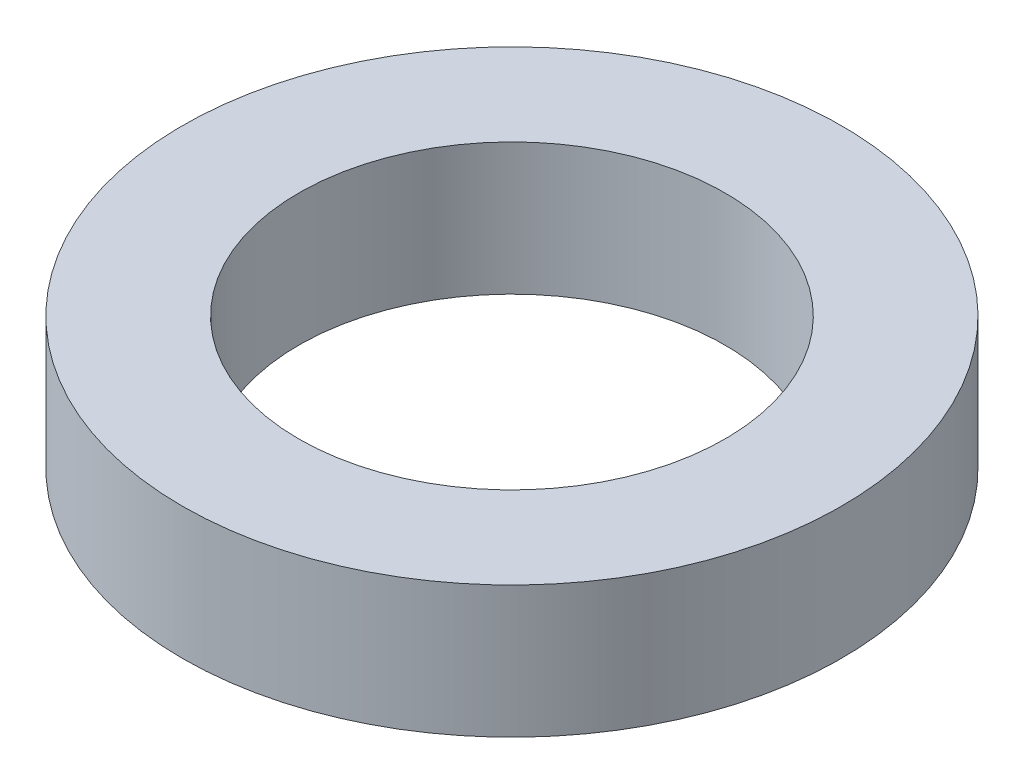
ISO-10303-21;
HEADER;
FILE_DESCRIPTION(('STEP AP214'),'2;1');
FILE_NAME('part.step','',(''),(''),'','','');
FILE_SCHEMA(('AUTOMOTIVE_DESIGN { 1 0 10303 214 1 1 1 1 }'));
ENDSEC;
DATA;
#1=APPLICATION_CONTEXT('core data for automotive mechanical design processes');
#2=APPLICATION_PROTOCOL_DEFINITION('international standard','automotive_design',2000,#1);
#3=PRODUCT_CONTEXT('',#1,'mechanical');
#4=PRODUCT('Part','Part','',(#3));
#5=PRODUCT_RELATED_PRODUCT_CATEGORY('part','',(#4));
#6=PRODUCT_DEFINITION_FORMATION('','',#4);
#7=PRODUCT_DEFINITION_CONTEXT('part definition',#1,'design');
#8=PRODUCT_DEFINITION('design','',#6,#7);
#9=PRODUCT_DEFINITION_SHAPE('','',#8);
#10=(LENGTH_UNIT() NAMED_UNIT(*) SI_UNIT(.MILLI.,.METRE.));
#11=(NAMED_UNIT(*) PLANE_ANGLE_UNIT() SI_UNIT($,.RADIAN.));
#12=(NAMED_UNIT(*) SI_UNIT($,.STERADIAN.) SOLID_ANGLE_UNIT());
#13=UNCERTAINTY_MEASURE_WITH_UNIT(LENGTH_MEASURE(1.E-05),#10,'distance_accuracy_value','');
#14=(GEOMETRIC_REPRESENTATION_CONTEXT(3) GLOBAL_UNCERTAINTY_ASSIGNED_CONTEXT((#13)) GLOBAL_UNIT_ASSIGNED_CONTEXT((#10,
#11,#12)) REPRESENTATION_CONTEXT('',''));
#15=CARTESIAN_POINT('',(0.,0.,0.));
#16=DIRECTION('',(0.,0.,1.));
#17=DIRECTION('',(1.,0.,0.));
#18=AXIS2_PLACEMENT_3D('',#15,#16,#17);
#19=CARTESIAN_POINT('',(0.,3.81,0.));
#20=DIRECTION('',(0.,1.,0.));
#21=DIRECTION('',(0.,0.,1.));
#22=AXIS2_PLACEMENT_3D('',#19,#20,#21);
#23=PLANE('',#22);
#24=CARTESIAN_POINT('',(0.,3.81,0.));
#25=DIRECTION('',(0.,1.,0.));
#26=DIRECTION('',(0.,0.,1.));
#27=AXIS2_PLACEMENT_3D('',#24,#25,#26);
#28=CIRCLE('',#27,9.525);
#29=CARTESIAN_POINT('',(0.,3.81,9.525));
#30=VERTEX_POINT('',#29);
#31=EDGE_CURVE('E10',#30,#30,#28,.T.);
#32=ORIENTED_EDGE('',*,*,#31,.T.);
#33=EDGE_LOOP('',(#32));
#34=FACE_BOUND('',#33,.T.);
#35=CARTESIAN_POINT('',(0.,3.81,0.));
#36=DIRECTION('',(0.,1.,0.));
#37=DIRECTION('',(0.,0.,1.));
#38=AXIS2_PLACEMENT_3D('',#35,#36,#37);
#39=CIRCLE('',#38,6.1595);
#40=CARTESIAN_POINT('',(0.,3.81,6.1595));
#41=VERTEX_POINT('',#40);
#42=EDGE_CURVE('E42',#41,#41,#39,.T.);
#43=ORIENTED_EDGE('',*,*,#42,.F.);
#44=EDGE_LOOP('',(#43));
#45=FACE_BOUND('',#44,.T.);
#46=ADVANCED_FACE('F31',(#34,#45),#23,.T.);
#47=CARTESIAN_POINT('',(0.,0.,0.));
#48=DIRECTION('',(0.,1.,0.));
#49=DIRECTION('',(0.,0.,1.));
#50=AXIS2_PLACEMENT_3D('',#47,#48,#49);
#51=PLANE('',#50);
#52=CARTESIAN_POINT('',(0.,0.,0.));
#53=DIRECTION('',(0.,1.,0.));
#54=DIRECTION('',(0.,0.,1.));
#55=AXIS2_PLACEMENT_3D('',#52,#53,#54);
#56=CIRCLE('',#55,9.525);
#57=CARTESIAN_POINT('',(0.,0.,9.525));
#58=VERTEX_POINT('',#57);
#59=EDGE_CURVE('E35',#58,#58,#56,.T.);
#60=ORIENTED_EDGE('',*,*,#59,.F.);
#61=EDGE_LOOP('',(#60));
#62=FACE_BOUND('',#61,.T.);
#63=CARTESIAN_POINT('',(0.,0.,0.));
#64=DIRECTION('',(0.,1.,0.));
#65=DIRECTION('',(0.,0.,1.));
#66=AXIS2_PLACEMENT_3D('',#63,#64,#65);
#67=CIRCLE('',#66,6.1595);
#68=CARTESIAN_POINT('',(0.,0.,6.1595));
#69=VERTEX_POINT('',#68);
#70=EDGE_CURVE('E44',#69,#69,#67,.T.);
#71=ORIENTED_EDGE('',*,*,#70,.T.);
#72=EDGE_LOOP('',(#71));
#73=FACE_BOUND('',#72,.T.);
#74=ADVANCED_FACE('F54',(#62,#73),#51,.F.);
#75=CARTESIAN_POINT('',(0.,3.81,0.));
#76=DIRECTION('',(0.,-1.,0.));
#77=DIRECTION('',(0.,0.,-1.));
#78=AXIS2_PLACEMENT_3D('',#75,#76,#77);
#79=CYLINDRICAL_SURFACE('',#78,9.525);
#80=ORIENTED_EDGE('',*,*,#31,.F.);
#81=EDGE_LOOP('',(#80));
#82=FACE_BOUND('',#81,.T.);
#83=ORIENTED_EDGE('',*,*,#59,.T.);
#84=EDGE_LOOP('',(#83));
#85=FACE_BOUND('',#84,.T.);
#86=ADVANCED_FACE('F33',(#82,#85),#79,.T.);
#87=CARTESIAN_POINT('',(0.,3.81,0.));
#88=DIRECTION('',(0.,-1.,0.));
#89=DIRECTION('',(0.,0.,-1.));
#90=AXIS2_PLACEMENT_3D('',#87,#88,#89);
#91=CYLINDRICAL_SURFACE('',#90,6.1595);
#92=ORIENTED_EDGE('',*,*,#42,.T.);
#93=EDGE_LOOP('',(#92));
#94=FACE_BOUND('',#93,.T.);
#95=ORIENTED_EDGE('',*,*,#70,.F.);
#96=EDGE_LOOP('',(#95));
#97=FACE_BOUND('',#96,.T.);
#98=ADVANCED_FACE('F50',(#94,#97),#91,.F.);
#99=CLOSED_SHELL('',(#46,#74,#86,#98));
#100=MANIFOLD_SOLID_BREP('B2',#99);
#101=ADVANCED_BREP_SHAPE_REPRESENTATION('',(#18,#100),#14);
#102=SHAPE_DEFINITION_REPRESENTATION(#9,#101);
ENDSEC;
END-ISO-10303-21;
